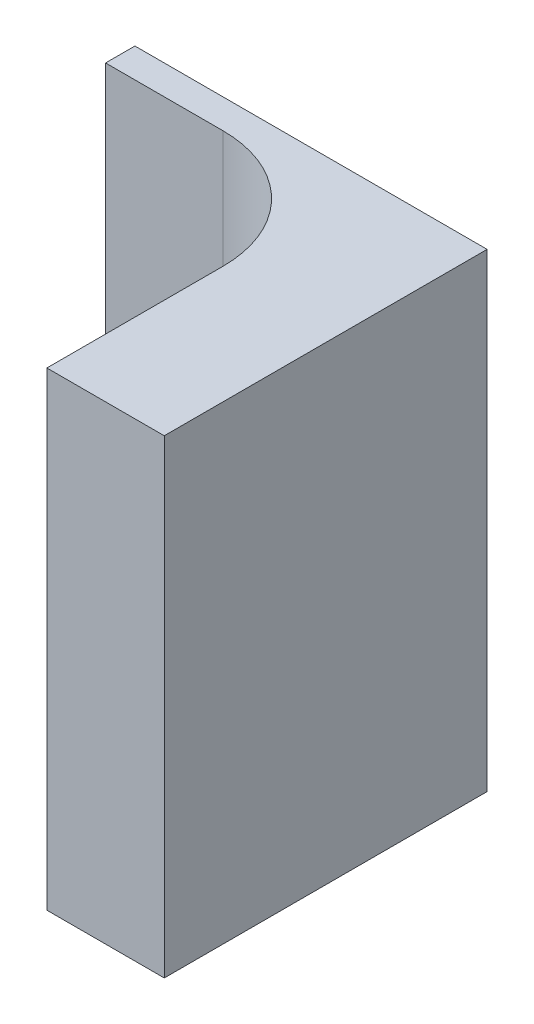
ISO-10303-21;
HEADER;
FILE_DESCRIPTION(('STEP AP214'),'2;1');
FILE_NAME('part.step','',(''),(''),'','','');
FILE_SCHEMA(('AUTOMOTIVE_DESIGN { 1 0 10303 214 1 1 1 1 }'));
ENDSEC;
DATA;
#1=APPLICATION_CONTEXT('core data for automotive mechanical design processes');
#2=APPLICATION_PROTOCOL_DEFINITION('international standard','automotive_design',2000,#1);
#3=PRODUCT_CONTEXT('',#1,'mechanical');
#4=PRODUCT('Part','Part','',(#3));
#5=PRODUCT_RELATED_PRODUCT_CATEGORY('part','',(#4));
#6=PRODUCT_DEFINITION_FORMATION('','',#4);
#7=PRODUCT_DEFINITION_CONTEXT('part definition',#1,'design');
#8=PRODUCT_DEFINITION('design','',#6,#7);
#9=PRODUCT_DEFINITION_SHAPE('','',#8);
#10=(LENGTH_UNIT() NAMED_UNIT(*) SI_UNIT(.MILLI.,.METRE.));
#11=(NAMED_UNIT(*) PLANE_ANGLE_UNIT() SI_UNIT($,.RADIAN.));
#12=(NAMED_UNIT(*) SI_UNIT($,.STERADIAN.) SOLID_ANGLE_UNIT());
#13=UNCERTAINTY_MEASURE_WITH_UNIT(LENGTH_MEASURE(1.E-05),#10,'distance_accuracy_value','');
#14=(GEOMETRIC_REPRESENTATION_CONTEXT(3) GLOBAL_UNCERTAINTY_ASSIGNED_CONTEXT((#13)) GLOBAL_UNIT_ASSIGNED_CONTEXT((#10,
#11,#12)) REPRESENTATION_CONTEXT('',''));
#15=CARTESIAN_POINT('',(0.,0.,0.));
#16=DIRECTION('',(0.,0.,1.));
#17=DIRECTION('',(1.,0.,0.));
#18=AXIS2_PLACEMENT_3D('',#15,#16,#17);
#19=CARTESIAN_POINT('',(0.,0.,19.05));
#20=DIRECTION('',(0.,0.,1.));
#21=DIRECTION('',(1.,0.,0.));
#22=AXIS2_PLACEMENT_3D('',#19,#20,#21);
#23=PLANE('',#22);
#24=DIRECTION('',(1.,0.,0.));
#25=VECTOR('',#24,1.);
#26=CARTESIAN_POINT('',(-38.1,-25.4,19.05));
#27=LINE('',#26,#25);
#28=CARTESIAN_POINT('',(-38.1,-25.4,19.05));
#29=VERTEX_POINT('',#28);
#30=CARTESIAN_POINT('',(-25.4,-25.4,19.05));
#31=VERTEX_POINT('',#30);
#32=EDGE_CURVE('E131',#29,#31,#27,.T.);
#33=ORIENTED_EDGE('',*,*,#32,.T.);
#34=DIRECTION('',(0.,1.,0.));
#35=VECTOR('',#34,1.);
#36=CARTESIAN_POINT('',(-25.4,25.4,19.05));
#37=LINE('',#36,#35);
#38=CARTESIAN_POINT('',(-25.4,25.4,19.05));
#39=VERTEX_POINT('',#38);
#40=EDGE_CURVE('E104',#31,#39,#37,.T.);
#41=ORIENTED_EDGE('',*,*,#40,.T.);
#42=DIRECTION('',(-1.,0.,0.));
#43=VECTOR('',#42,1.);
#44=CARTESIAN_POINT('',(0.,25.4,19.05));
#45=LINE('',#44,#43);
#46=CARTESIAN_POINT('',(-38.1,25.4,19.05));
#47=VERTEX_POINT('',#46);
#48=EDGE_CURVE('E126',#39,#47,#45,.T.);
#49=ORIENTED_EDGE('',*,*,#48,.T.);
#50=DIRECTION('',(0.,-1.,0.));
#51=VECTOR('',#50,1.);
#52=CARTESIAN_POINT('',(-38.1,25.4,19.05));
#53=LINE('',#52,#51);
#54=EDGE_CURVE('E128',#47,#29,#53,.T.);
#55=ORIENTED_EDGE('',*,*,#54,.T.);
#56=EDGE_LOOP('',(#33,#41,#49,#55));
#57=FACE_BOUND('',#56,.T.);
#58=ADVANCED_FACE('F37',(#57),#23,.T.);
#59=CARTESIAN_POINT('',(0.,-25.4,19.05));
#60=DIRECTION('',(-1.,0.,0.));
#61=DIRECTION('',(0.,-1.,0.));
#62=AXIS2_PLACEMENT_3D('',#59,#60,#61);
#63=PLANE('',#62);
#64=DIRECTION('',(0.,1.,0.));
#65=VECTOR('',#64,1.);
#66=CARTESIAN_POINT('',(0.,-25.4,15.875));
#67=LINE('',#66,#65);
#68=CARTESIAN_POINT('',(0.,-25.4,15.875));
#69=VERTEX_POINT('',#68);
#70=CARTESIAN_POINT('',(0.,25.4,15.875));
#71=VERTEX_POINT('',#70);
#72=EDGE_CURVE('E103',#69,#71,#67,.T.);
#73=ORIENTED_EDGE('',*,*,#72,.T.);
#74=DIRECTION('',(0.,0.,-1.));
#75=VECTOR('',#74,1.);
#76=CARTESIAN_POINT('',(0.,25.4,19.05));
#77=LINE('',#76,#75);
#78=CARTESIAN_POINT('',(0.,25.4,50.8));
#79=VERTEX_POINT('',#78);
#80=EDGE_CURVE('E95',#79,#71,#77,.T.);
#81=ORIENTED_EDGE('',*,*,#80,.F.);
#82=DIRECTION('',(0.,1.,0.));
#83=VECTOR('',#82,1.);
#84=CARTESIAN_POINT('',(0.,-25.4,50.8));
#85=LINE('',#84,#83);
#86=CARTESIAN_POINT('',(0.,-25.4,50.8));
#87=VERTEX_POINT('',#86);
#88=EDGE_CURVE('E100',#87,#79,#85,.T.);
#89=ORIENTED_EDGE('',*,*,#88,.F.);
#90=DIRECTION('',(0.,0.,-1.));
#91=VECTOR('',#90,1.);
#92=CARTESIAN_POINT('',(0.,-25.4,19.05));
#93=LINE('',#92,#91);
#94=EDGE_CURVE('E134',#87,#69,#93,.T.);
#95=ORIENTED_EDGE('',*,*,#94,.T.);
#96=EDGE_LOOP('',(#73,#81,#89,#95));
#97=FACE_BOUND('',#96,.T.);
#98=ADVANCED_FACE('F97',(#97),#63,.F.);
#99=CARTESIAN_POINT('',(0.,25.4,19.05));
#100=DIRECTION('',(0.,-1.,0.));
#101=DIRECTION('',(0.,0.,-1.));
#102=AXIS2_PLACEMENT_3D('',#99,#100,#101);
#103=PLANE('',#102);
#104=DIRECTION('',(-1.,0.,0.));
#105=VECTOR('',#104,1.);
#106=CARTESIAN_POINT('',(0.,25.4,15.875));
#107=LINE('',#106,#105);
#108=CARTESIAN_POINT('',(-38.1,25.4,15.875));
#109=VERTEX_POINT('',#108);
#110=EDGE_CURVE('E136',#71,#109,#107,.T.);
#111=ORIENTED_EDGE('',*,*,#110,.T.);
#112=DIRECTION('',(0.,0.,-1.));
#113=VECTOR('',#112,1.);
#114=CARTESIAN_POINT('',(-38.1,25.4,19.05));
#115=LINE('',#114,#113);
#116=EDGE_CURVE('E105',#47,#109,#115,.T.);
#117=ORIENTED_EDGE('',*,*,#116,.F.);
#118=ORIENTED_EDGE('',*,*,#48,.F.);
#119=CARTESIAN_POINT('',(-25.4,25.4,31.75));
#120=DIRECTION('',(0.,-1.,0.));
#121=DIRECTION('',(0.,0.,-1.));
#122=AXIS2_PLACEMENT_3D('',#119,#120,#121);
#123=CIRCLE('',#122,12.7);
#124=CARTESIAN_POINT('',(-12.7,25.4,31.75));
#125=VERTEX_POINT('',#124);
#126=EDGE_CURVE('E45',#39,#125,#123,.T.);
#127=ORIENTED_EDGE('',*,*,#126,.T.);
#128=DIRECTION('',(0.,0.,1.));
#129=VECTOR('',#128,1.);
#130=CARTESIAN_POINT('',(-12.7,25.4,-33.3134414453443));
#131=LINE('',#130,#129);
#132=CARTESIAN_POINT('',(-12.7,25.4,50.8));
#133=VERTEX_POINT('',#132);
#134=EDGE_CURVE('E110',#125,#133,#131,.T.);
#135=ORIENTED_EDGE('',*,*,#134,.T.);
#136=DIRECTION('',(-1.,0.,0.));
#137=VECTOR('',#136,1.);
#138=CARTESIAN_POINT('',(0.,25.4,50.8));
#139=LINE('',#138,#137);
#140=EDGE_CURVE('E108',#79,#133,#139,.T.);
#141=ORIENTED_EDGE('',*,*,#140,.F.);
#142=ORIENTED_EDGE('',*,*,#80,.T.);
#143=EDGE_LOOP('',(#111,#117,#118,#127,#135,#141,#142));
#144=FACE_BOUND('',#143,.T.);
#145=ADVANCED_FACE('F109',(#144),#103,.F.);
#146=CARTESIAN_POINT('',(-38.1,25.4,19.05));
#147=DIRECTION('',(1.,0.,0.));
#148=DIRECTION('',(0.,1.,0.));
#149=AXIS2_PLACEMENT_3D('',#146,#147,#148);
#150=PLANE('',#149);
#151=DIRECTION('',(0.,-1.,0.));
#152=VECTOR('',#151,1.);
#153=CARTESIAN_POINT('',(-38.1,25.4,15.875));
#154=LINE('',#153,#152);
#155=CARTESIAN_POINT('',(-38.1,-25.4,15.875));
#156=VERTEX_POINT('',#155);
#157=EDGE_CURVE('E138',#109,#156,#154,.T.);
#158=ORIENTED_EDGE('',*,*,#157,.T.);
#159=DIRECTION('',(0.,0.,-1.));
#160=VECTOR('',#159,1.);
#161=CARTESIAN_POINT('',(-38.1,-25.4,19.05));
#162=LINE('',#161,#160);
#163=EDGE_CURVE('E143',#29,#156,#162,.T.);
#164=ORIENTED_EDGE('',*,*,#163,.F.);
#165=ORIENTED_EDGE('',*,*,#54,.F.);
#166=ORIENTED_EDGE('',*,*,#116,.T.);
#167=EDGE_LOOP('',(#158,#164,#165,#166));
#168=FACE_BOUND('',#167,.T.);
#169=ADVANCED_FACE('F160',(#168),#150,.F.);
#170=CARTESIAN_POINT('',(-25.4,-25.4,19.05));
#171=DIRECTION('',(0.,1.,0.));
#172=DIRECTION('',(-1.,0.,0.));
#173=AXIS2_PLACEMENT_3D('',#170,#171,#172);
#174=PLANE('',#173);
#175=DIRECTION('',(1.,0.,0.));
#176=VECTOR('',#175,1.);
#177=CARTESIAN_POINT('',(-25.4,-25.4,15.875));
#178=LINE('',#177,#176);
#179=EDGE_CURVE('E129',#156,#69,#178,.T.);
#180=ORIENTED_EDGE('',*,*,#179,.T.);
#181=ORIENTED_EDGE('',*,*,#94,.F.);
#182=DIRECTION('',(1.,0.,0.));
#183=VECTOR('',#182,1.);
#184=CARTESIAN_POINT('',(-12.7,-25.4,50.8));
#185=LINE('',#184,#183);
#186=CARTESIAN_POINT('',(-12.7,-25.4,50.8));
#187=VERTEX_POINT('',#186);
#188=EDGE_CURVE('E118',#187,#87,#185,.T.);
#189=ORIENTED_EDGE('',*,*,#188,.F.);
#190=DIRECTION('',(0.,0.,1.));
#191=VECTOR('',#190,1.);
#192=CARTESIAN_POINT('',(-12.7,-25.4,-33.3134414453443));
#193=LINE('',#192,#191);
#194=CARTESIAN_POINT('',(-12.7,-25.4,31.75));
#195=VERTEX_POINT('',#194);
#196=EDGE_CURVE('E123',#195,#187,#193,.T.);
#197=ORIENTED_EDGE('',*,*,#196,.F.);
#198=CARTESIAN_POINT('',(-25.4,-25.4,31.75));
#199=DIRECTION('',(0.,1.,0.));
#200=DIRECTION('',(-1.,0.,0.));
#201=AXIS2_PLACEMENT_3D('',#198,#199,#200);
#202=CIRCLE('',#201,12.7);
#203=EDGE_CURVE('E11',#195,#31,#202,.T.);
#204=ORIENTED_EDGE('',*,*,#203,.T.);
#205=ORIENTED_EDGE('',*,*,#32,.F.);
#206=ORIENTED_EDGE('',*,*,#163,.T.);
#207=EDGE_LOOP('',(#180,#181,#189,#197,#204,#205,#206));
#208=FACE_BOUND('',#207,.T.);
#209=ADVANCED_FACE('F162',(#208),#174,.F.);
#210=CARTESIAN_POINT('',(0.,0.,15.875));
#211=DIRECTION('',(0.,0.,1.));
#212=DIRECTION('',(1.,0.,0.));
#213=AXIS2_PLACEMENT_3D('',#210,#211,#212);
#214=PLANE('',#213);
#215=ORIENTED_EDGE('',*,*,#72,.F.);
#216=ORIENTED_EDGE('',*,*,#179,.F.);
#217=ORIENTED_EDGE('',*,*,#157,.F.);
#218=ORIENTED_EDGE('',*,*,#110,.F.);
#219=EDGE_LOOP('',(#215,#216,#217,#218));
#220=FACE_BOUND('',#219,.T.);
#221=ADVANCED_FACE('F176',(#220),#214,.F.);
#222=CARTESIAN_POINT('',(-12.7,25.4,-33.3134414453443));
#223=DIRECTION('',(-1.,0.,0.));
#224=DIRECTION('',(0.,-1.,0.));
#225=AXIS2_PLACEMENT_3D('',#222,#223,#224);
#226=PLANE('',#225);
#227=ORIENTED_EDGE('',*,*,#134,.F.);
#228=DIRECTION('',(0.,1.,0.));
#229=VECTOR('',#228,1.);
#230=CARTESIAN_POINT('',(-12.7,-25.4,31.75));
#231=LINE('',#230,#229);
#232=EDGE_CURVE('E58',#125,#195,#231,.F.);
#233=ORIENTED_EDGE('',*,*,#232,.T.);
#234=ORIENTED_EDGE('',*,*,#196,.T.);
#235=DIRECTION('',(0.,-1.,0.));
#236=VECTOR('',#235,1.);
#237=CARTESIAN_POINT('',(-12.7,25.4,50.8));
#238=LINE('',#237,#236);
#239=EDGE_CURVE('E114',#133,#187,#238,.T.);
#240=ORIENTED_EDGE('',*,*,#239,.F.);
#241=EDGE_LOOP('',(#227,#233,#234,#240));
#242=FACE_BOUND('',#241,.T.);
#243=ADVANCED_FACE('F167',(#242),#226,.T.);
#244=CARTESIAN_POINT('',(0.,0.,50.8));
#245=DIRECTION('',(0.,0.,1.));
#246=DIRECTION('',(1.,0.,0.));
#247=AXIS2_PLACEMENT_3D('',#244,#245,#246);
#248=PLANE('',#247);
#249=ORIENTED_EDGE('',*,*,#88,.T.);
#250=ORIENTED_EDGE('',*,*,#140,.T.);
#251=ORIENTED_EDGE('',*,*,#239,.T.);
#252=ORIENTED_EDGE('',*,*,#188,.T.);
#253=EDGE_LOOP('',(#249,#250,#251,#252));
#254=FACE_BOUND('',#253,.T.);
#255=ADVANCED_FACE('F116',(#254),#248,.T.);
#256=CARTESIAN_POINT('',(-25.4,0.,31.75));
#257=DIRECTION('',(0.,-1.,0.));
#258=DIRECTION('',(1.,0.,0.));
#259=AXIS2_PLACEMENT_3D('',#256,#257,#258);
#260=CYLINDRICAL_SURFACE('',#259,12.7);
#261=ORIENTED_EDGE('',*,*,#203,.F.);
#262=ORIENTED_EDGE('',*,*,#232,.F.);
#263=ORIENTED_EDGE('',*,*,#126,.F.);
#264=ORIENTED_EDGE('',*,*,#40,.F.);
#265=EDGE_LOOP('',(#261,#262,#263,#264));
#266=FACE_BOUND('',#265,.T.);
#267=ADVANCED_FACE('F39',(#266),#260,.F.);
#268=CLOSED_SHELL('',(#58,#98,#145,#169,#209,#221,#243,#255,#267));
#269=MANIFOLD_SOLID_BREP('B2',#268);
#270=ADVANCED_BREP_SHAPE_REPRESENTATION('',(#18,#269),#14);
#271=SHAPE_DEFINITION_REPRESENTATION(#9,#270);
ENDSEC;
END-ISO-10303-21;
